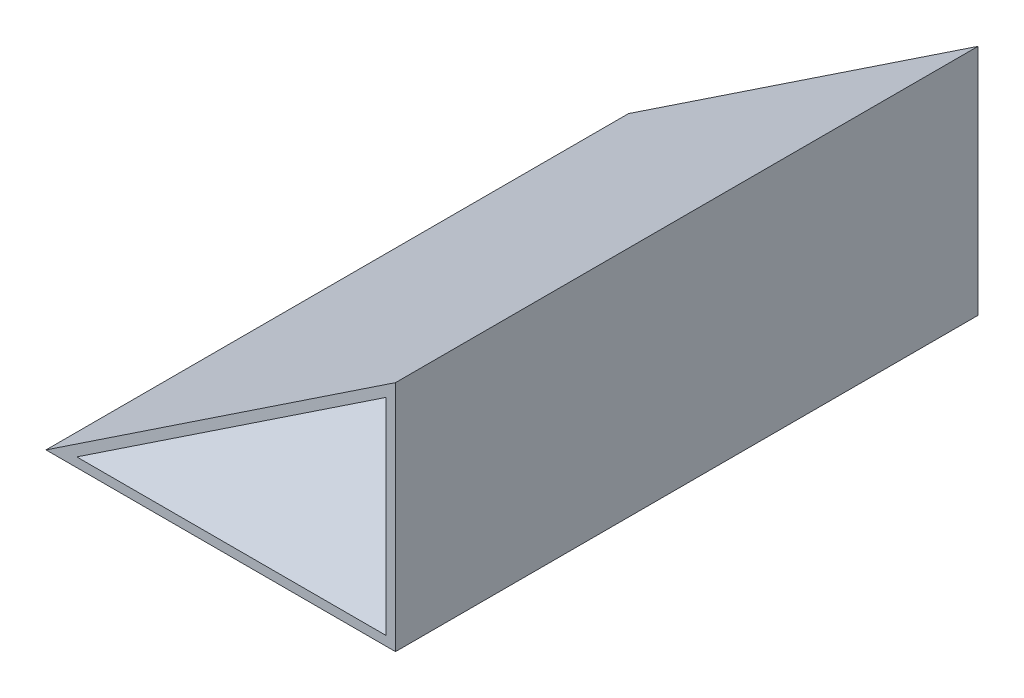
ISO-10303-21;
HEADER;
FILE_DESCRIPTION(('STEP AP214'),'2;1');
FILE_NAME('part.step','',(''),(''),'','','');
FILE_SCHEMA(('AUTOMOTIVE_DESIGN { 1 0 10303 214 1 1 1 1 }'));
ENDSEC;
DATA;
#1=APPLICATION_CONTEXT('core data for automotive mechanical design processes');
#2=APPLICATION_PROTOCOL_DEFINITION('international standard','automotive_design',2000,#1);
#3=PRODUCT_CONTEXT('',#1,'mechanical');
#4=PRODUCT('Part','Part','',(#3));
#5=PRODUCT_RELATED_PRODUCT_CATEGORY('part','',(#4));
#6=PRODUCT_DEFINITION_FORMATION('','',#4);
#7=PRODUCT_DEFINITION_CONTEXT('part definition',#1,'design');
#8=PRODUCT_DEFINITION('design','',#6,#7);
#9=PRODUCT_DEFINITION_SHAPE('','',#8);
#10=(LENGTH_UNIT() NAMED_UNIT(*) SI_UNIT(.MILLI.,.METRE.));
#11=(NAMED_UNIT(*) PLANE_ANGLE_UNIT() SI_UNIT($,.RADIAN.));
#12=(NAMED_UNIT(*) SI_UNIT($,.STERADIAN.) SOLID_ANGLE_UNIT());
#13=UNCERTAINTY_MEASURE_WITH_UNIT(LENGTH_MEASURE(1.E-05),#10,'distance_accuracy_value','');
#14=(GEOMETRIC_REPRESENTATION_CONTEXT(3) GLOBAL_UNCERTAINTY_ASSIGNED_CONTEXT((#13)) GLOBAL_UNIT_ASSIGNED_CONTEXT((#10,
#11,#12)) REPRESENTATION_CONTEXT('',''));
#15=CARTESIAN_POINT('',(0.,0.,0.));
#16=DIRECTION('',(0.,0.,1.));
#17=DIRECTION('',(1.,0.,0.));
#18=AXIS2_PLACEMENT_3D('',#15,#16,#17);
#19=CARTESIAN_POINT('',(45.3586497890295,68.1434599156118,250.));
#20=DIRECTION('',(0.554700196225229,-0.832050294337844,0.));
#21=DIRECTION('',(0.832050294337844,0.554700196225229,0.));
#22=AXIS2_PLACEMENT_3D('',#19,#20,#21);
#23=PLANE('',#22);
#24=DIRECTION('',(-0.832050294337844,-0.554700196225229,0.));
#25=VECTOR('',#24,1.);
#26=CARTESIAN_POINT('',(45.3586497890295,68.1434599156118,0.));
#27=LINE('',#26,#25);
#28=CARTESIAN_POINT('',(45.3586497890295,68.1434599156118,0.));
#29=VERTEX_POINT('',#28);
#30=CARTESIAN_POINT('',(-104.64135021097,-31.8565400843882,0.));
#31=VERTEX_POINT('',#30);
#32=EDGE_CURVE('E129',#29,#31,#27,.T.);
#33=ORIENTED_EDGE('',*,*,#32,.T.);
#34=DIRECTION('',(0.,0.,-1.));
#35=VECTOR('',#34,1.);
#36=CARTESIAN_POINT('',(-104.64135021097,-31.8565400843882,250.));
#37=LINE('',#36,#35);
#38=CARTESIAN_POINT('',(-104.64135021097,-31.8565400843882,250.));
#39=VERTEX_POINT('',#38);
#40=EDGE_CURVE('E11',#39,#31,#37,.T.);
#41=ORIENTED_EDGE('',*,*,#40,.F.);
#42=DIRECTION('',(-0.832050294337844,-0.554700196225229,0.));
#43=VECTOR('',#42,1.);
#44=CARTESIAN_POINT('',(45.3586497890295,68.1434599156118,250.));
#45=LINE('',#44,#43);
#46=CARTESIAN_POINT('',(45.3586497890295,68.1434599156118,250.));
#47=VERTEX_POINT('',#46);
#48=EDGE_CURVE('E132',#47,#39,#45,.T.);
#49=ORIENTED_EDGE('',*,*,#48,.F.);
#50=DIRECTION('',(0.,0.,-1.));
#51=VECTOR('',#50,1.);
#52=CARTESIAN_POINT('',(45.3586497890295,68.1434599156118,250.));
#53=LINE('',#52,#51);
#54=EDGE_CURVE('E143',#47,#29,#53,.T.);
#55=ORIENTED_EDGE('',*,*,#54,.T.);
#56=EDGE_LOOP('',(#33,#41,#49,#55));
#57=FACE_BOUND('',#56,.T.);
#58=ADVANCED_FACE('F42',(#57),#23,.F.);
#59=CARTESIAN_POINT('',(-104.64135021097,-31.8565400843882,250.));
#60=DIRECTION('',(0.,1.,0.));
#61=DIRECTION('',(0.,0.,1.));
#62=AXIS2_PLACEMENT_3D('',#59,#60,#61);
#63=PLANE('',#62);
#64=DIRECTION('',(1.,0.,0.));
#65=VECTOR('',#64,1.);
#66=CARTESIAN_POINT('',(-104.64135021097,-31.8565400843882,0.));
#67=LINE('',#66,#65);
#68=CARTESIAN_POINT('',(45.3586497890295,-31.8565400843882,0.));
#69=VERTEX_POINT('',#68);
#70=EDGE_CURVE('E147',#31,#69,#67,.T.);
#71=ORIENTED_EDGE('',*,*,#70,.T.);
#72=DIRECTION('',(0.,0.,-1.));
#73=VECTOR('',#72,1.);
#74=CARTESIAN_POINT('',(45.3586497890295,-31.8565400843882,250.));
#75=LINE('',#74,#73);
#76=CARTESIAN_POINT('',(45.3586497890295,-31.8565400843882,250.));
#77=VERTEX_POINT('',#76);
#78=EDGE_CURVE('E50',#77,#69,#75,.T.);
#79=ORIENTED_EDGE('',*,*,#78,.F.);
#80=DIRECTION('',(1.,0.,0.));
#81=VECTOR('',#80,1.);
#82=CARTESIAN_POINT('',(-104.64135021097,-31.8565400843882,250.));
#83=LINE('',#82,#81);
#84=EDGE_CURVE('E136',#39,#77,#83,.T.);
#85=ORIENTED_EDGE('',*,*,#84,.F.);
#86=ORIENTED_EDGE('',*,*,#40,.T.);
#87=EDGE_LOOP('',(#71,#79,#85,#86));
#88=FACE_BOUND('',#87,.T.);
#89=ADVANCED_FACE('F169',(#88),#63,.F.);
#90=CARTESIAN_POINT('',(45.3586497890295,-31.8565400843882,250.));
#91=DIRECTION('',(-1.,0.,0.));
#92=DIRECTION('',(0.,0.,1.));
#93=AXIS2_PLACEMENT_3D('',#90,#91,#92);
#94=PLANE('',#93);
#95=DIRECTION('',(0.,1.,0.));
#96=VECTOR('',#95,1.);
#97=CARTESIAN_POINT('',(45.3586497890295,-31.8565400843882,0.));
#98=LINE('',#97,#96);
#99=EDGE_CURVE('E137',#69,#29,#98,.T.);
#100=ORIENTED_EDGE('',*,*,#99,.T.);
#101=ORIENTED_EDGE('',*,*,#54,.F.);
#102=DIRECTION('',(0.,1.,0.));
#103=VECTOR('',#102,1.);
#104=CARTESIAN_POINT('',(45.3586497890295,-31.8565400843882,250.));
#105=LINE('',#104,#103);
#106=EDGE_CURVE('E140',#77,#47,#105,.T.);
#107=ORIENTED_EDGE('',*,*,#106,.F.);
#108=ORIENTED_EDGE('',*,*,#78,.T.);
#109=EDGE_LOOP('',(#100,#101,#107,#108));
#110=FACE_BOUND('',#109,.T.);
#111=ADVANCED_FACE('F160',(#110),#94,.F.);
#112=CARTESIAN_POINT('',(0.,0.,250.));
#113=DIRECTION('',(0.,0.,-1.));
#114=DIRECTION('',(-1.,0.,0.));
#115=AXIS2_PLACEMENT_3D('',#112,#113,#114);
#116=PLANE('',#115);
#117=DIRECTION('',(1.,0.,0.));
#118=VECTOR('',#117,1.);
#119=CARTESIAN_POINT('',(-91.4302476600424,-27.8565400843882,250.));
#120=LINE('',#119,#118);
#121=CARTESIAN_POINT('',(-91.4302476600424,-27.8565400843882,250.));
#122=VERTEX_POINT('',#121);
#123=CARTESIAN_POINT('',(41.3586497890295,-27.8565400843882,250.));
#124=VERTEX_POINT('',#123);
#125=EDGE_CURVE('E117',#122,#124,#120,.T.);
#126=ORIENTED_EDGE('',*,*,#125,.F.);
#127=DIRECTION('',(-0.832050294337843,-0.554700196225229,0.));
#128=VECTOR('',#127,1.);
#129=CARTESIAN_POINT('',(-91.4302476600424,-27.8565400843882,250.));
#130=LINE('',#129,#128);
#131=CARTESIAN_POINT('',(41.3586497890295,60.6693915483265,250.));
#132=VERTEX_POINT('',#131);
#133=EDGE_CURVE('E57',#132,#122,#130,.T.);
#134=ORIENTED_EDGE('',*,*,#133,.F.);
#135=DIRECTION('',(0.,1.,0.));
#136=VECTOR('',#135,1.);
#137=CARTESIAN_POINT('',(41.3586497890295,60.6693915483265,250.));
#138=LINE('',#137,#136);
#139=EDGE_CURVE('E113',#124,#132,#138,.T.);
#140=ORIENTED_EDGE('',*,*,#139,.F.);
#141=EDGE_LOOP('',(#126,#134,#140));
#142=FACE_BOUND('',#141,.T.);
#143=ORIENTED_EDGE('',*,*,#48,.T.);
#144=ORIENTED_EDGE('',*,*,#84,.T.);
#145=ORIENTED_EDGE('',*,*,#106,.T.);
#146=EDGE_LOOP('',(#143,#144,#145));
#147=FACE_BOUND('',#146,.T.);
#148=ADVANCED_FACE('F168',(#142,#147),#116,.F.);
#149=CARTESIAN_POINT('',(0.,0.,0.));
#150=DIRECTION('',(0.,0.,-1.));
#151=DIRECTION('',(-1.,0.,0.));
#152=AXIS2_PLACEMENT_3D('',#149,#150,#151);
#153=PLANE('',#152);
#154=DIRECTION('',(-0.832050294337843,-0.554700196225229,0.));
#155=VECTOR('',#154,1.);
#156=CARTESIAN_POINT('',(-91.4302476600424,-27.8565400843882,0.));
#157=LINE('',#156,#155);
#158=CARTESIAN_POINT('',(41.3586497890295,60.6693915483265,0.));
#159=VERTEX_POINT('',#158);
#160=CARTESIAN_POINT('',(-91.4302476600424,-27.8565400843882,0.));
#161=VERTEX_POINT('',#160);
#162=EDGE_CURVE('E97',#159,#161,#157,.T.);
#163=ORIENTED_EDGE('',*,*,#162,.T.);
#164=DIRECTION('',(1.,0.,0.));
#165=VECTOR('',#164,1.);
#166=CARTESIAN_POINT('',(-91.4302476600424,-27.8565400843882,0.));
#167=LINE('',#166,#165);
#168=CARTESIAN_POINT('',(41.3586497890295,-27.8565400843882,0.));
#169=VERTEX_POINT('',#168);
#170=EDGE_CURVE('E105',#161,#169,#167,.T.);
#171=ORIENTED_EDGE('',*,*,#170,.T.);
#172=DIRECTION('',(0.,1.,0.));
#173=VECTOR('',#172,1.);
#174=CARTESIAN_POINT('',(41.3586497890295,60.6693915483265,0.));
#175=LINE('',#174,#173);
#176=EDGE_CURVE('E65',#169,#159,#175,.T.);
#177=ORIENTED_EDGE('',*,*,#176,.T.);
#178=EDGE_LOOP('',(#163,#171,#177));
#179=FACE_BOUND('',#178,.T.);
#180=ORIENTED_EDGE('',*,*,#32,.F.);
#181=ORIENTED_EDGE('',*,*,#99,.F.);
#182=ORIENTED_EDGE('',*,*,#70,.F.);
#183=EDGE_LOOP('',(#180,#181,#182));
#184=FACE_BOUND('',#183,.T.);
#185=ADVANCED_FACE('F110',(#179,#184),#153,.T.);
#186=CARTESIAN_POINT('',(-91.4302476600424,-27.8565400843882,0.));
#187=DIRECTION('',(-0.554700196225229,0.832050294337843,0.));
#188=DIRECTION('',(-0.832050294337843,-0.554700196225229,0.));
#189=AXIS2_PLACEMENT_3D('',#186,#187,#188);
#190=PLANE('',#189);
#191=ORIENTED_EDGE('',*,*,#133,.T.);
#192=DIRECTION('',(0.,0.,1.));
#193=VECTOR('',#192,1.);
#194=CARTESIAN_POINT('',(-91.4302476600424,-27.8565400843882,0.));
#195=LINE('',#194,#193);
#196=EDGE_CURVE('E93',#161,#122,#195,.T.);
#197=ORIENTED_EDGE('',*,*,#196,.F.);
#198=ORIENTED_EDGE('',*,*,#162,.F.);
#199=DIRECTION('',(0.,0.,1.));
#200=VECTOR('',#199,1.);
#201=CARTESIAN_POINT('',(41.3586497890295,60.6693915483265,0.));
#202=LINE('',#201,#200);
#203=EDGE_CURVE('E126',#159,#132,#202,.T.);
#204=ORIENTED_EDGE('',*,*,#203,.T.);
#205=EDGE_LOOP('',(#191,#197,#198,#204));
#206=FACE_BOUND('',#205,.T.);
#207=ADVANCED_FACE('F95',(#206),#190,.F.);
#208=CARTESIAN_POINT('',(41.3586497890295,60.6693915483265,0.));
#209=DIRECTION('',(1.,0.,0.));
#210=DIRECTION('',(0.,0.,-1.));
#211=AXIS2_PLACEMENT_3D('',#208,#209,#210);
#212=PLANE('',#211);
#213=ORIENTED_EDGE('',*,*,#139,.T.);
#214=ORIENTED_EDGE('',*,*,#203,.F.);
#215=ORIENTED_EDGE('',*,*,#176,.F.);
#216=DIRECTION('',(0.,0.,1.));
#217=VECTOR('',#216,1.);
#218=CARTESIAN_POINT('',(41.3586497890295,-27.8565400843882,0.));
#219=LINE('',#218,#217);
#220=EDGE_CURVE('E102',#169,#124,#219,.T.);
#221=ORIENTED_EDGE('',*,*,#220,.T.);
#222=EDGE_LOOP('',(#213,#214,#215,#221));
#223=FACE_BOUND('',#222,.T.);
#224=ADVANCED_FACE('F184',(#223),#212,.F.);
#225=CARTESIAN_POINT('',(-91.4302476600424,-27.8565400843882,0.));
#226=DIRECTION('',(0.,-1.,0.));
#227=DIRECTION('',(1.,0.,0.));
#228=AXIS2_PLACEMENT_3D('',#225,#226,#227);
#229=PLANE('',#228);
#230=ORIENTED_EDGE('',*,*,#125,.T.);
#231=ORIENTED_EDGE('',*,*,#220,.F.);
#232=ORIENTED_EDGE('',*,*,#170,.F.);
#233=ORIENTED_EDGE('',*,*,#196,.T.);
#234=EDGE_LOOP('',(#230,#231,#232,#233));
#235=FACE_BOUND('',#234,.T.);
#236=ADVANCED_FACE('F106',(#235),#229,.F.);
#237=CLOSED_SHELL('',(#58,#89,#111,#148,#185,#207,#224,#236));
#238=MANIFOLD_SOLID_BREP('B2',#237);
#239=ADVANCED_BREP_SHAPE_REPRESENTATION('',(#18,#238),#14);
#240=SHAPE_DEFINITION_REPRESENTATION(#9,#239);
ENDSEC;
END-ISO-10303-21;
